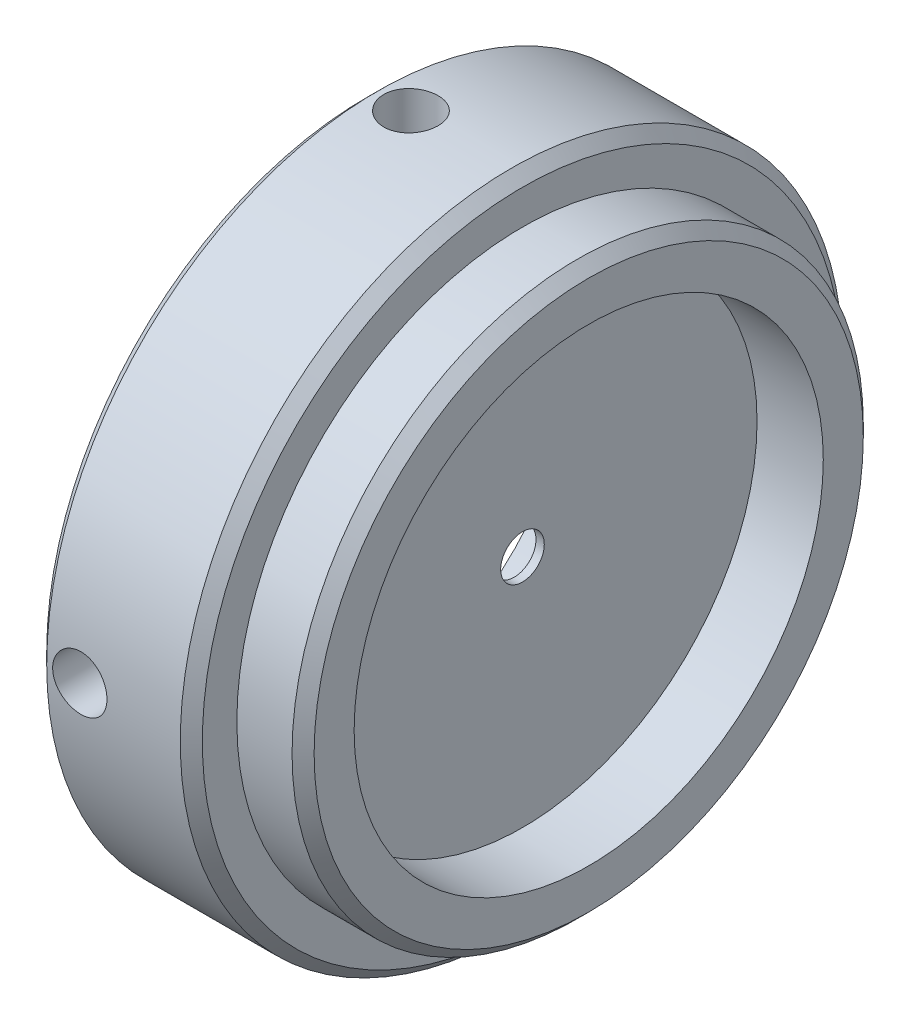
ISO-10303-21;
HEADER;
FILE_DESCRIPTION(('STEP AP214'),'2;1');
FILE_NAME('part.step','',(''),(''),'','','');
FILE_SCHEMA(('AUTOMOTIVE_DESIGN { 1 0 10303 214 1 1 1 1 }'));
ENDSEC;
DATA;
#1=APPLICATION_CONTEXT('core data for automotive mechanical design processes');
#2=APPLICATION_PROTOCOL_DEFINITION('international standard','automotive_design',2000,#1);
#3=PRODUCT_CONTEXT('',#1,'mechanical');
#4=PRODUCT('Part','Part','',(#3));
#5=PRODUCT_RELATED_PRODUCT_CATEGORY('part','',(#4));
#6=PRODUCT_DEFINITION_FORMATION('','',#4);
#7=PRODUCT_DEFINITION_CONTEXT('part definition',#1,'design');
#8=PRODUCT_DEFINITION('design','',#6,#7);
#9=PRODUCT_DEFINITION_SHAPE('','',#8);
#10=(LENGTH_UNIT() NAMED_UNIT(*) SI_UNIT(.MILLI.,.METRE.));
#11=(NAMED_UNIT(*) PLANE_ANGLE_UNIT() SI_UNIT($,.RADIAN.));
#12=(NAMED_UNIT(*) SI_UNIT($,.STERADIAN.) SOLID_ANGLE_UNIT());
#13=UNCERTAINTY_MEASURE_WITH_UNIT(LENGTH_MEASURE(1.E-05),#10,'distance_accuracy_value','');
#14=(GEOMETRIC_REPRESENTATION_CONTEXT(3) GLOBAL_UNCERTAINTY_ASSIGNED_CONTEXT((#13)) GLOBAL_UNIT_ASSIGNED_CONTEXT((#10,
#11,#12)) REPRESENTATION_CONTEXT('',''));
#15=CARTESIAN_POINT('',(0.,0.,0.));
#16=DIRECTION('',(0.,0.,1.));
#17=DIRECTION('',(1.,0.,0.));
#18=AXIS2_PLACEMENT_3D('',#15,#16,#17);
#19=CARTESIAN_POINT('',(-3.0988,5.7106676848107,0.));
#20=DIRECTION('',(-1.,0.,0.));
#21=DIRECTION('',(0.,0.,1.));
#22=AXIS2_PLACEMENT_3D('',#19,#20,#21);
#23=PLANE('',#22);
#24=CARTESIAN_POINT('',(-3.0988,0.,0.));
#25=DIRECTION('',(1.,0.,0.));
#26=DIRECTION('',(0.,0.,-1.));
#27=AXIS2_PLACEMENT_3D('',#24,#25,#26);
#28=CIRCLE('',#27,5.7106676848107);
#29=CARTESIAN_POINT('',(-3.0988,0.,-5.7106676848107));
#30=VERTEX_POINT('',#29);
#31=EDGE_CURVE('E62',#30,#30,#28,.T.);
#32=ORIENTED_EDGE('',*,*,#31,.T.);
#33=EDGE_LOOP('',(#32));
#34=FACE_BOUND('',#33,.T.);
#35=CARTESIAN_POINT('',(-3.0988,0.,0.));
#36=DIRECTION('',(1.,0.,0.));
#37=DIRECTION('',(0.,0.,-1.));
#38=AXIS2_PLACEMENT_3D('',#35,#36,#37);
#39=CIRCLE('',#38,9.525);
#40=CARTESIAN_POINT('',(-3.0988,0.,-9.525));
#41=VERTEX_POINT('',#40);
#42=EDGE_CURVE('E83',#41,#41,#39,.T.);
#43=ORIENTED_EDGE('',*,*,#42,.F.);
#44=EDGE_LOOP('',(#43));
#45=FACE_BOUND('',#44,.T.);
#46=ADVANCED_FACE('F36',(#34,#45),#23,.T.);
#47=CARTESIAN_POINT('',(-3.0988,0.,0.));
#48=DIRECTION('',(-1.,0.,0.));
#49=DIRECTION('',(0.,0.,1.));
#50=AXIS2_PLACEMENT_3D('',#47,#48,#49);
#51=CONICAL_SURFACE('',#50,5.7106676848107,1.0471975511966);
#52=CARTESIAN_POINT('',(-0.381000000000007,0.,0.));
#53=DIRECTION('',(1.,0.,0.));
#54=DIRECTION('',(0.,0.,-1.));
#55=AXIS2_PLACEMENT_3D('',#52,#53,#54);
#56=CIRCLE('',#55,1.0033);
#57=CARTESIAN_POINT('',(-0.381000000000007,0.,-1.0033));
#58=VERTEX_POINT('',#57);
#59=EDGE_CURVE('E65',#58,#58,#56,.T.);
#60=ORIENTED_EDGE('',*,*,#59,.T.);
#61=EDGE_LOOP('',(#60));
#62=FACE_BOUND('',#61,.T.);
#63=ORIENTED_EDGE('',*,*,#31,.F.);
#64=EDGE_LOOP('',(#63));
#65=FACE_BOUND('',#64,.T.);
#66=ADVANCED_FACE('F124',(#62,#65),#51,.F.);
#67=CARTESIAN_POINT('',(0.,0.,0.));
#68=DIRECTION('',(1.,0.,0.));
#69=DIRECTION('',(0.,0.,-1.));
#70=AXIS2_PLACEMENT_3D('',#67,#68,#69);
#71=CYLINDRICAL_SURFACE('',#70,1.0033);
#72=CARTESIAN_POINT('',(0.,0.,0.));
#73=DIRECTION('',(1.,0.,0.));
#74=DIRECTION('',(0.,0.,-1.));
#75=AXIS2_PLACEMENT_3D('',#72,#73,#74);
#76=CIRCLE('',#75,1.0033);
#77=CARTESIAN_POINT('',(0.,0.,-1.0033));
#78=VERTEX_POINT('',#77);
#79=EDGE_CURVE('E68',#78,#78,#76,.T.);
#80=ORIENTED_EDGE('',*,*,#79,.T.);
#81=EDGE_LOOP('',(#80));
#82=FACE_BOUND('',#81,.T.);
#83=ORIENTED_EDGE('',*,*,#59,.F.);
#84=EDGE_LOOP('',(#83));
#85=FACE_BOUND('',#84,.T.);
#86=ADVANCED_FACE('F130',(#82,#85),#71,.F.);
#87=CARTESIAN_POINT('',(0.,10.795,0.));
#88=DIRECTION('',(1.,0.,0.));
#89=DIRECTION('',(0.,0.,-1.));
#90=AXIS2_PLACEMENT_3D('',#87,#88,#89);
#91=PLANE('',#90);
#92=CARTESIAN_POINT('',(0.,0.,0.));
#93=DIRECTION('',(1.,0.,0.));
#94=DIRECTION('',(0.,0.,-1.));
#95=AXIS2_PLACEMENT_3D('',#92,#93,#94);
#96=CIRCLE('',#95,10.795);
#97=CARTESIAN_POINT('',(0.,0.,-10.795));
#98=VERTEX_POINT('',#97);
#99=EDGE_CURVE('E71',#98,#98,#96,.T.);
#100=ORIENTED_EDGE('',*,*,#99,.T.);
#101=EDGE_LOOP('',(#100));
#102=FACE_BOUND('',#101,.T.);
#103=ORIENTED_EDGE('',*,*,#79,.F.);
#104=EDGE_LOOP('',(#103));
#105=FACE_BOUND('',#104,.T.);
#106=ADVANCED_FACE('F167',(#102,#105),#91,.T.);
#107=CARTESIAN_POINT('',(0.,0.,0.));
#108=DIRECTION('',(1.,0.,0.));
#109=DIRECTION('',(0.,0.,-1.));
#110=AXIS2_PLACEMENT_3D('',#107,#108,#109);
#111=CYLINDRICAL_SURFACE('',#110,10.795);
#112=CARTESIAN_POINT('',(3.048,0.,0.));
#113=DIRECTION('',(1.,0.,0.));
#114=DIRECTION('',(0.,0.,-1.));
#115=AXIS2_PLACEMENT_3D('',#112,#113,#114);
#116=CIRCLE('',#115,10.795);
#117=CARTESIAN_POINT('',(3.048,0.,-10.795));
#118=VERTEX_POINT('',#117);
#119=EDGE_CURVE('E74',#118,#118,#116,.T.);
#120=ORIENTED_EDGE('',*,*,#119,.T.);
#121=EDGE_LOOP('',(#120));
#122=FACE_BOUND('',#121,.T.);
#123=ORIENTED_EDGE('',*,*,#99,.F.);
#124=EDGE_LOOP('',(#123));
#125=FACE_BOUND('',#124,.T.);
#126=ADVANCED_FACE('F161',(#122,#125),#111,.F.);
#127=CARTESIAN_POINT('',(3.048,13.1445,0.));
#128=DIRECTION('',(1.,0.,0.));
#129=DIRECTION('',(0.,0.,-1.));
#130=AXIS2_PLACEMENT_3D('',#127,#128,#129);
#131=PLANE('',#130);
#132=CARTESIAN_POINT('',(3.048,0.,0.));
#133=DIRECTION('',(1.,0.,0.));
#134=DIRECTION('',(0.,0.,-1.));
#135=AXIS2_PLACEMENT_3D('',#132,#133,#134);
#136=CIRCLE('',#135,12.6365);
#137=CARTESIAN_POINT('',(3.048,0.,-12.6365));
#138=VERTEX_POINT('',#137);
#139=EDGE_CURVE('E59',#138,#138,#136,.T.);
#140=ORIENTED_EDGE('',*,*,#139,.T.);
#141=EDGE_LOOP('',(#140));
#142=FACE_BOUND('',#141,.T.);
#143=ORIENTED_EDGE('',*,*,#119,.F.);
#144=EDGE_LOOP('',(#143));
#145=FACE_BOUND('',#144,.T.);
#146=ADVANCED_FACE('F155',(#142,#145),#131,.T.);
#147=CARTESIAN_POINT('',(0.,0.,0.));
#148=DIRECTION('',(1.,0.,0.));
#149=DIRECTION('',(0.,0.,-1.));
#150=AXIS2_PLACEMENT_3D('',#147,#148,#149);
#151=CYLINDRICAL_SURFACE('',#150,13.1445);
#152=CARTESIAN_POINT('',(2.54,0.,0.));
#153=DIRECTION('',(1.,0.,0.));
#154=DIRECTION('',(0.,0.,-1.));
#155=AXIS2_PLACEMENT_3D('',#152,#153,#154);
#156=CIRCLE('',#155,13.1445);
#157=CARTESIAN_POINT('',(2.54,0.,-13.1445));
#158=VERTEX_POINT('',#157);
#159=EDGE_CURVE('E56',#158,#158,#156,.F.);
#160=ORIENTED_EDGE('',*,*,#159,.T.);
#161=EDGE_LOOP('',(#160));
#162=FACE_BOUND('',#161,.T.);
#163=CARTESIAN_POINT('',(0.,0.,0.));
#164=DIRECTION('',(1.,0.,0.));
#165=DIRECTION('',(0.,0.,-1.));
#166=AXIS2_PLACEMENT_3D('',#163,#164,#165);
#167=CIRCLE('',#166,13.1445);
#168=CARTESIAN_POINT('',(0.,0.,-13.1445));
#169=VERTEX_POINT('',#168);
#170=EDGE_CURVE('E77',#169,#169,#167,.T.);
#171=ORIENTED_EDGE('',*,*,#170,.T.);
#172=EDGE_LOOP('',(#171));
#173=FACE_BOUND('',#172,.T.);
#174=ADVANCED_FACE('F151',(#162,#173),#151,.T.);
#175=CARTESIAN_POINT('',(0.,15.24,0.));
#176=DIRECTION('',(1.,0.,0.));
#177=DIRECTION('',(0.,0.,-1.));
#178=AXIS2_PLACEMENT_3D('',#175,#176,#177);
#179=PLANE('',#178);
#180=CARTESIAN_POINT('',(0.,0.,0.));
#181=DIRECTION('',(1.,0.,0.));
#182=DIRECTION('',(0.,0.,-1.));
#183=AXIS2_PLACEMENT_3D('',#180,#181,#182);
#184=CIRCLE('',#183,14.732);
#185=CARTESIAN_POINT('',(0.,0.,-14.732));
#186=VERTEX_POINT('',#185);
#187=EDGE_CURVE('E51',#186,#186,#184,.T.);
#188=ORIENTED_EDGE('',*,*,#187,.T.);
#189=EDGE_LOOP('',(#188));
#190=FACE_BOUND('',#189,.T.);
#191=ORIENTED_EDGE('',*,*,#170,.F.);
#192=EDGE_LOOP('',(#191));
#193=FACE_BOUND('',#192,.T.);
#194=ADVANCED_FACE('F121',(#190,#193),#179,.T.);
#195=CARTESIAN_POINT('',(0.,0.,0.));
#196=DIRECTION('',(1.,0.,0.));
#197=DIRECTION('',(0.,0.,-1.));
#198=AXIS2_PLACEMENT_3D('',#195,#196,#197);
#199=CYLINDRICAL_SURFACE('',#198,15.24);
#200=CARTESIAN_POINT('',(-0.508000000000004,0.,0.));
#201=DIRECTION('',(1.,0.,0.));
#202=DIRECTION('',(0.,0.,-1.));
#203=AXIS2_PLACEMENT_3D('',#200,#201,#202);
#204=CIRCLE('',#203,15.24);
#205=CARTESIAN_POINT('',(-0.508000000000004,0.,-15.24));
#206=VERTEX_POINT('',#205);
#207=EDGE_CURVE('E43',#206,#206,#204,.F.);
#208=ORIENTED_EDGE('',*,*,#207,.T.);
#209=EDGE_LOOP('',(#208));
#210=FACE_BOUND('',#209,.T.);
#211=CARTESIAN_POINT('',(-6.6548,0.,0.));
#212=DIRECTION('',(-1.,0.,0.));
#213=DIRECTION('',(0.,0.,1.));
#214=AXIS2_PLACEMENT_3D('',#211,#212,#213);
#215=CIRCLE('',#214,15.24);
#216=CARTESIAN_POINT('',(-6.6548,0.,15.24));
#217=VERTEX_POINT('',#216);
#218=EDGE_CURVE('E47',#217,#217,#215,.F.);
#219=ORIENTED_EDGE('',*,*,#218,.T.);
#220=EDGE_LOOP('',(#219));
#221=FACE_BOUND('',#220,.T.);
#222=CARTESIAN_POINT('',(-5.1308,15.1886503679557,1.25));
#223=CARTESIAN_POINT('',(-5.06071376947096,15.1886510487574,1.24999693665967));
#224=CARTESIAN_POINT('',(-4.9905797281011,15.1891406969732,1.24408567548658));
#225=CARTESIAN_POINT('',(-4.85225188020233,15.1910463824904,1.22059139305494));
#226=CARTESIAN_POINT('',(-4.78406036816819,15.1924634714853,1.20299512097024));
#227=CARTESIAN_POINT('',(-4.65164106916812,15.1960624624168,1.15664289534043));
#228=CARTESIAN_POINT('',(-4.58741106977679,15.1982439328291,1.12789323735693));
#229=CARTESIAN_POINT('',(-4.46470382552808,15.2031253491898,1.06006146540772));
#230=CARTESIAN_POINT('',(-4.40622534827616,15.2058251836993,1.02098157157719));
#231=CARTESIAN_POINT('',(-4.29652006129159,15.2114466794332,0.933493393358492));
#232=CARTESIAN_POINT('',(-4.24530955134249,15.2143688173725,0.885064698746849));
#233=CARTESIAN_POINT('',(-4.15173387804897,15.2201012980882,0.780296762023627));
#234=CARTESIAN_POINT('',(-4.1093690998852,15.2229116359922,0.723957175616873));
#235=CARTESIAN_POINT('',(-4.03463346129712,15.228108361628,0.604869786886786));
#236=CARTESIAN_POINT('',(-4.00227667241689,15.2304941504484,0.542113125326034));
#237=CARTESIAN_POINT('',(-3.94856551501322,15.2345678332319,0.412034835764901));
#238=CARTESIAN_POINT('',(-3.92721095926648,15.2362557390707,0.344713285466593));
#239=CARTESIAN_POINT('',(-3.89615727856568,15.2387401450296,0.207578213182864));
#240=CARTESIAN_POINT('',(-3.88643182344337,15.2395386585959,0.137770690609393));
#241=CARTESIAN_POINT('',(-3.87883102440433,15.2401611295789,-0.00249015693999184));
#242=CARTESIAN_POINT('',(-3.88095546630844,15.2399851046098,-0.0729434702206811));
#243=CARTESIAN_POINT('',(-3.89697260997993,15.2386799943906,-0.212317468424485));
#244=CARTESIAN_POINT('',(-3.91083699706375,15.2375532022469,-0.281241431787787));
#245=CARTESIAN_POINT('',(-3.94989645143923,15.2344759425071,-0.415780663920283));
#246=CARTESIAN_POINT('',(-3.97509162367785,15.232525467282,-0.481395902037446));
#247=CARTESIAN_POINT('',(-4.03612904334449,15.2280163393211,-0.607545264830665));
#248=CARTESIAN_POINT('',(-4.07198398244936,15.2254569623477,-0.668073221698355));
#249=CARTESIAN_POINT('',(-4.15331392937552,15.2200176799822,-0.78226253449803));
#250=CARTESIAN_POINT('',(-4.19878912613711,15.2171377682956,-0.835923755535216));
#251=CARTESIAN_POINT('',(-4.29822832150583,15.2113710942443,-0.935021883888042));
#252=CARTESIAN_POINT('',(-4.35221692179629,15.2084843366779,-0.980434108758529));
#253=CARTESIAN_POINT('',(-4.46706461721358,15.203037863758,-1.06155449480594));
#254=CARTESIAN_POINT('',(-4.52792371775046,15.2004781486621,-1.09726264834149));
#255=CARTESIAN_POINT('',(-4.65480206062534,15.1959750915957,-1.15796027056289));
#256=CARTESIAN_POINT('',(-4.72082191025799,15.1940318223023,-1.18294847551995));
#257=CARTESIAN_POINT('',(-4.85613949857541,15.1909830700441,-1.22147869108227));
#258=CARTESIAN_POINT('',(-4.92543717049907,15.1898775700237,-1.23502093470749));
#259=CARTESIAN_POINT('',(-5.06512736263481,15.1886322712494,-1.25024360196574));
#260=CARTESIAN_POINT('',(-5.13551610888563,15.1884896709407,-1.25195843772964));
#261=CARTESIAN_POINT('',(-5.27558008154828,15.1891789216219,-1.24356773705735));
#262=CARTESIAN_POINT('',(-5.34525531439856,15.190010763811,-1.23346230737726));
#263=CARTESIAN_POINT('',(-5.48181574979161,15.1925526159258,-1.20174661274641));
#264=CARTESIAN_POINT('',(-5.54870470329089,15.1942614010699,-1.18015239206539));
#265=CARTESIAN_POINT('',(-5.67791001052796,15.1983635826996,-1.12608840241363));
#266=CARTESIAN_POINT('',(-5.74022629313223,15.2007569898324,-1.0936184643014));
#267=CARTESIAN_POINT('',(-5.85867484301249,15.2059655281507,-1.01863760380737));
#268=CARTESIAN_POINT('',(-5.91479254560598,15.2087816173889,-0.976103740898647));
#269=CARTESIAN_POINT('',(-6.01910379145066,15.214514966683,-0.882235561024442));
#270=CARTESIAN_POINT('',(-6.06729720254288,15.2174322284252,-0.830901097314325));
#271=CARTESIAN_POINT('',(-6.15450920421622,15.2230475496415,-0.720740249978711));
#272=CARTESIAN_POINT('',(-6.19350544268864,15.2257450648643,-0.661896139110731));
#273=CARTESIAN_POINT('',(-6.26106280253717,15.2306091116672,-0.538474751670093));
#274=CARTESIAN_POINT('',(-6.289624025386,15.2327756484105,-0.473897530855233));
#275=CARTESIAN_POINT('',(-6.33546218372748,15.2363311167826,-0.340923275837679));
#276=CARTESIAN_POINT('',(-6.35275296449343,15.2377210021946,-0.272531040830158));
#277=CARTESIAN_POINT('',(-6.3756046719817,15.2395704331906,-0.133802274194766));
#278=CARTESIAN_POINT('',(-6.38116581310292,15.2400299957794,-0.0634657781286585));
#279=CARTESIAN_POINT('',(-6.38039791356778,15.2399670290435,0.0769345243982014));
#280=CARTESIAN_POINT('',(-6.37410371781067,15.2394473777968,0.146998525366217));
#281=CARTESIAN_POINT('',(-6.34987644755059,15.2374900680651,0.285070822349682));
#282=CARTESIAN_POINT('',(-6.33194335684046,15.2360524083019,0.353079115502424));
#283=CARTESIAN_POINT('',(-6.28495614469714,15.2324204077344,0.485111947474416));
#284=CARTESIAN_POINT('',(-6.25590261905166,15.2302261074686,0.549136699502014));
#285=CARTESIAN_POINT('',(-6.18750329303653,15.2253263754577,0.671405377599671));
#286=CARTESIAN_POINT('',(-6.14815766279731,15.2226209521618,0.729649399204351));
#287=CARTESIAN_POINT('',(-6.06016026868922,15.2169932162182,0.838881548781791));
#288=CARTESIAN_POINT('',(-6.01148274335006,15.2140703172074,0.889848892966019));
#289=CARTESIAN_POINT('',(-5.90624936996131,15.2083420391511,0.982910147379538));
#290=CARTESIAN_POINT('',(-5.84969161542808,15.2055366887587,1.02500190410334));
#291=CARTESIAN_POINT('',(-5.73019674905055,15.2003555726044,1.09917224408041));
#292=CARTESIAN_POINT('',(-5.66724816796558,15.1979806012672,1.13123238792295));
#293=CARTESIAN_POINT('',(-5.53688507229848,15.1939388661739,1.18428723191015));
#294=CARTESIAN_POINT('',(-5.46947580031743,15.1922712875341,1.20529467100044));
#295=CARTESIAN_POINT('',(-5.35652313182699,15.1902626019648,1.23028958299843));
#296=CARTESIAN_POINT('',(-5.31170646739039,15.1896607879226,1.23767118313616));
#297=CARTESIAN_POINT('',(-5.22153321479678,15.188854451043,1.24752737695141));
#298=CARTESIAN_POINT('',(-5.17617662803748,15.1886499271774,1.25000198332901));
#299=CARTESIAN_POINT('',(-5.1308,15.1886503679557,1.25));
#300=B_SPLINE_CURVE_WITH_KNOTS('',3,(#222,#223,#224,#225,#226,#227,#228,#229,#230,#231,#232,
#233,#234,#235,#236,#237,#238,#239,#240,#241,#242,#243,#244,#245,#246,#247,#248,#249,#250,#251,
#252,#253,#254,#255,#256,#257,#258,#259,#260,#261,#262,#263,#264,#265,#266,#267,#268,#269,#270,
#271,#272,#273,#274,#275,#276,#277,#278,#279,#280,#281,#282,#283,#284,#285,#286,#287,#288,#289,
#290,#291,#292,#293,#294,#295,#296,#297,#298,#299),.UNSPECIFIED.,.T.,.F.,(4,2,2,2,2,2,2,2,2,2,2,
2,2,2,2,2,2,2,2,2,2,2,2,2,2,2,2,2,2,2,2,2,2,2,2,2,2,2,4),(0.,0.210093014811108,0.42042468330576,
0.630637801802253,0.840805778771281,1.05143789069166,1.26207917251502,1.47301529014935,
1.68394781819759,1.89440185098846,2.10485207997246,2.31479618096626,2.5247422265251,
2.73493924489037,2.94514039187428,3.15596049351967,3.36678076117285,3.57762587469913,
3.78846669568032,3.99869381040831,4.20891902646037,4.41885142749332,4.62878709359161,
4.83920599436575,5.04962840408763,5.26055705672531,5.47148365818499,5.68215065421329,
5.89281379955542,6.10285873525329,6.31290396343906,6.52293793982973,6.7329684445383,
6.9435873297619,7.15425725930736,7.36531218317591,7.57612331696313,7.71214628735576,
7.84816890569883),.UNSPECIFIED.);
#301=CARTESIAN_POINT('',(-5.1308,15.1886503679557,1.25));
#302=VERTEX_POINT('',#301);
#303=EDGE_CURVE('E263',#302,#302,#300,.T.);
#304=ORIENTED_EDGE('',*,*,#303,.F.);
#305=EDGE_LOOP('',(#304));
#306=FACE_BOUND('',#305,.T.);
#307=CARTESIAN_POINT('',(-5.1308,-1.25,15.1886503679557));
#308=CARTESIAN_POINT('',(-5.06071376947096,-1.24999693665967,15.1886510487574));
#309=CARTESIAN_POINT('',(-4.99057972810109,-1.24408567548658,15.1891406969732));
#310=CARTESIAN_POINT('',(-4.85225188020233,-1.22059139305494,15.1910463824904));
#311=CARTESIAN_POINT('',(-4.78406036816819,-1.20299512097024,15.1924634714853));
#312=CARTESIAN_POINT('',(-4.65164106916812,-1.15664289534043,15.1960624624168));
#313=CARTESIAN_POINT('',(-4.58741106977679,-1.12789323735693,15.1982439328291));
#314=CARTESIAN_POINT('',(-4.46470382552807,-1.06006146540772,15.2031253491898));
#315=CARTESIAN_POINT('',(-4.40622534827616,-1.02098157157719,15.2058251836993));
#316=CARTESIAN_POINT('',(-4.29652006129159,-0.933493393358492,15.2114466794332));
#317=CARTESIAN_POINT('',(-4.24530955134249,-0.885064698746849,15.2143688173725));
#318=CARTESIAN_POINT('',(-4.15173387804897,-0.780296762023627,15.2201012980882));
#319=CARTESIAN_POINT('',(-4.1093690998852,-0.723957175616872,15.2229116359922));
#320=CARTESIAN_POINT('',(-4.03463346129712,-0.604869786886785,15.228108361628));
#321=CARTESIAN_POINT('',(-4.00227667241689,-0.542113125326033,15.2304941504484));
#322=CARTESIAN_POINT('',(-3.94856551501322,-0.4120348357649,15.2345678332319));
#323=CARTESIAN_POINT('',(-3.92721095926648,-0.344713285466592,15.2362557390707));
#324=CARTESIAN_POINT('',(-3.89615727856568,-0.207578213182863,15.2387401450296));
#325=CARTESIAN_POINT('',(-3.88643182344337,-0.137770690609392,15.2395386585959));
#326=CARTESIAN_POINT('',(-3.87883102440433,0.00249015693999267,15.2401611295789));
#327=CARTESIAN_POINT('',(-3.88095546630844,0.0729434702206819,15.2399851046098));
#328=CARTESIAN_POINT('',(-3.89697260997993,0.212317468424486,15.2386799943906));
#329=CARTESIAN_POINT('',(-3.91083699706375,0.281241431787788,15.2375532022469));
#330=CARTESIAN_POINT('',(-3.94989645143923,0.415780663920284,15.2344759425071));
#331=CARTESIAN_POINT('',(-3.97509162367785,0.481395902037446,15.232525467282));
#332=CARTESIAN_POINT('',(-4.03612904334449,0.607545264830666,15.2280163393211));
#333=CARTESIAN_POINT('',(-4.07198398244936,0.668073221698355,15.2254569623477));
#334=CARTESIAN_POINT('',(-4.15331392937552,0.782262534498031,15.2200176799822));
#335=CARTESIAN_POINT('',(-4.1987891261371,0.835923755535216,15.2171377682956));
#336=CARTESIAN_POINT('',(-4.29822832150583,0.935021883888043,15.2113710942443));
#337=CARTESIAN_POINT('',(-4.35221692179629,0.98043410875853,15.2084843366779));
#338=CARTESIAN_POINT('',(-4.46706461721358,1.06155449480594,15.203037863758));
#339=CARTESIAN_POINT('',(-4.52792371775046,1.09726264834149,15.2004781486621));
#340=CARTESIAN_POINT('',(-4.65480206062534,1.15796027056289,15.1959750915957));
#341=CARTESIAN_POINT('',(-4.72082191025799,1.18294847551995,15.1940318223023));
#342=CARTESIAN_POINT('',(-4.85613949857542,1.22147869108227,15.1909830700441));
#343=CARTESIAN_POINT('',(-4.92543717049907,1.23502093470749,15.1898775700237));
#344=CARTESIAN_POINT('',(-5.06512736263481,1.25024360196574,15.1886322712494));
#345=CARTESIAN_POINT('',(-5.13551610888563,1.25195843772964,15.1884896709407));
#346=CARTESIAN_POINT('',(-5.27558008154828,1.24356773705735,15.1891789216219));
#347=CARTESIAN_POINT('',(-5.34525531439856,1.23346230737726,15.190010763811));
#348=CARTESIAN_POINT('',(-5.48181574979161,1.20174661274641,15.1925526159258));
#349=CARTESIAN_POINT('',(-5.54870470329088,1.18015239206539,15.1942614010699));
#350=CARTESIAN_POINT('',(-5.67791001052796,1.12608840241363,15.1983635826996));
#351=CARTESIAN_POINT('',(-5.74022629313223,1.0936184643014,15.2007569898324));
#352=CARTESIAN_POINT('',(-5.8586748430125,1.01863760380737,15.2059655281507));
#353=CARTESIAN_POINT('',(-5.91479254560598,0.976103740898646,15.2087816173889));
#354=CARTESIAN_POINT('',(-6.01910379145066,0.88223556102444,15.214514966683));
#355=CARTESIAN_POINT('',(-6.06729720254288,0.830901097314324,15.2174322284252));
#356=CARTESIAN_POINT('',(-6.15450920421622,0.720740249978711,15.2230475496415));
#357=CARTESIAN_POINT('',(-6.19350544268864,0.66189613911073,15.2257450648643));
#358=CARTESIAN_POINT('',(-6.26106280253717,0.538474751670092,15.2306091116672));
#359=CARTESIAN_POINT('',(-6.289624025386,0.473897530855233,15.2327756484105));
#360=CARTESIAN_POINT('',(-6.33546218372748,0.340923275837678,15.2363311167826));
#361=CARTESIAN_POINT('',(-6.35275296449343,0.272531040830157,15.2377210021946));
#362=CARTESIAN_POINT('',(-6.3756046719817,0.133802274194765,15.2395704331906));
#363=CARTESIAN_POINT('',(-6.38116581310292,0.0634657781286575,15.2400299957794));
#364=CARTESIAN_POINT('',(-6.38039791356778,-0.0769345243982023,15.2399670290435));
#365=CARTESIAN_POINT('',(-6.37410371781067,-0.146998525366217,15.2394473777968));
#366=CARTESIAN_POINT('',(-6.34987644755059,-0.285070822349683,15.2374900680651));
#367=CARTESIAN_POINT('',(-6.33194335684046,-0.353079115502425,15.2360524083019));
#368=CARTESIAN_POINT('',(-6.28495614469714,-0.485111947474417,15.2324204077344));
#369=CARTESIAN_POINT('',(-6.25590261905166,-0.549136699502014,15.2302261074686));
#370=CARTESIAN_POINT('',(-6.18750329303653,-0.671405377599671,15.2253263754577));
#371=CARTESIAN_POINT('',(-6.14815766279731,-0.729649399204351,15.2226209521618));
#372=CARTESIAN_POINT('',(-6.06016026868922,-0.838881548781792,15.2169932162182));
#373=CARTESIAN_POINT('',(-6.01148274335005,-0.88984889296602,15.2140703172074));
#374=CARTESIAN_POINT('',(-5.90624936996131,-0.982910147379539,15.2083420391511));
#375=CARTESIAN_POINT('',(-5.84969161542808,-1.02500190410334,15.2055366887587));
#376=CARTESIAN_POINT('',(-5.73019674905054,-1.09917224408041,15.2003555726044));
#377=CARTESIAN_POINT('',(-5.66724816796558,-1.13123238792295,15.1979806012672));
#378=CARTESIAN_POINT('',(-5.53688507229848,-1.18428723191015,15.1939388661739));
#379=CARTESIAN_POINT('',(-5.46947580031743,-1.20529467100044,15.1922712875341));
#380=CARTESIAN_POINT('',(-5.35652313182699,-1.23028958299843,15.1902626019648));
#381=CARTESIAN_POINT('',(-5.31170646739039,-1.23767118313616,15.1896607879226));
#382=CARTESIAN_POINT('',(-5.22153321479678,-1.24752737695141,15.188854451043));
#383=CARTESIAN_POINT('',(-5.17617662803747,-1.25000198332901,15.1886499271774));
#384=CARTESIAN_POINT('',(-5.1308,-1.25,15.1886503679557));
#385=B_SPLINE_CURVE_WITH_KNOTS('',3,(#307,#308,#309,#310,#311,#312,#313,#314,#315,#316,#317,
#318,#319,#320,#321,#322,#323,#324,#325,#326,#327,#328,#329,#330,#331,#332,#333,#334,#335,#336,
#337,#338,#339,#340,#341,#342,#343,#344,#345,#346,#347,#348,#349,#350,#351,#352,#353,#354,#355,
#356,#357,#358,#359,#360,#361,#362,#363,#364,#365,#366,#367,#368,#369,#370,#371,#372,#373,#374,
#375,#376,#377,#378,#379,#380,#381,#382,#383,#384),.UNSPECIFIED.,.T.,.F.,(4,2,2,2,2,2,2,2,2,2,2,
2,2,2,2,2,2,2,2,2,2,2,2,2,2,2,2,2,2,2,2,2,2,2,2,2,2,2,4),(0.,0.210093014811109,
0.420424683305761,0.630637801802253,0.840805778771282,1.05143789069166,1.26207917251502,
1.47301529014935,1.68394781819759,1.89440185098846,2.10485207997246,2.31479618096626,
2.5247422265251,2.73493924489037,2.94514039187427,3.15596049351967,3.36678076117285,
3.57762587469913,3.78846669568032,3.99869381040831,4.20891902646037,4.41885142749332,
4.62878709359161,4.83920599436576,5.04962840408763,5.26055705672531,5.47148365818499,
5.68215065421329,5.89281379955542,6.10285873525329,6.31290396343906,6.52293793982974,
6.7329684445383,6.9435873297619,7.15425725930736,7.36531218317591,7.57612331696313,
7.71214628735576,7.84816890569883),.UNSPECIFIED.);
#386=CARTESIAN_POINT('',(-5.1308,-1.25,15.1886503679557));
#387=VERTEX_POINT('',#386);
#388=EDGE_CURVE('E86',#387,#387,#385,.T.);
#389=ORIENTED_EDGE('',*,*,#388,.F.);
#390=EDGE_LOOP('',(#389));
#391=FACE_BOUND('',#390,.T.);
#392=ADVANCED_FACE('F98',(#210,#221,#306,#391),#199,.T.);
#393=CARTESIAN_POINT('',(-7.1628,9.525,0.));
#394=DIRECTION('',(-1.,0.,0.));
#395=DIRECTION('',(0.,0.,1.));
#396=AXIS2_PLACEMENT_3D('',#393,#394,#395);
#397=PLANE('',#396);
#398=CARTESIAN_POINT('',(-7.1628,0.,0.));
#399=DIRECTION('',(-1.,0.,0.));
#400=DIRECTION('',(0.,0.,1.));
#401=AXIS2_PLACEMENT_3D('',#398,#399,#400);
#402=CIRCLE('',#401,14.732);
#403=CARTESIAN_POINT('',(-7.1628,0.,14.732));
#404=VERTEX_POINT('',#403);
#405=EDGE_CURVE('E11',#404,#404,#402,.T.);
#406=ORIENTED_EDGE('',*,*,#405,.T.);
#407=EDGE_LOOP('',(#406));
#408=FACE_BOUND('',#407,.T.);
#409=CARTESIAN_POINT('',(-7.1628,0.,0.));
#410=DIRECTION('',(1.,0.,0.));
#411=DIRECTION('',(0.,0.,-1.));
#412=AXIS2_PLACEMENT_3D('',#409,#410,#411);
#413=CIRCLE('',#412,9.525);
#414=CARTESIAN_POINT('',(-7.1628,0.,-9.525));
#415=VERTEX_POINT('',#414);
#416=EDGE_CURVE('E80',#415,#415,#413,.T.);
#417=ORIENTED_EDGE('',*,*,#416,.T.);
#418=EDGE_LOOP('',(#417));
#419=FACE_BOUND('',#418,.T.);
#420=ADVANCED_FACE('F115',(#408,#419),#397,.T.);
#421=CARTESIAN_POINT('',(0.,0.,0.));
#422=DIRECTION('',(1.,0.,0.));
#423=DIRECTION('',(0.,0.,-1.));
#424=AXIS2_PLACEMENT_3D('',#421,#422,#423);
#425=CYLINDRICAL_SURFACE('',#424,9.525);
#426=CARTESIAN_POINT('',(-5.1308,9.44262278183345,1.25));
#427=CARTESIAN_POINT('',(-5.2006879229246,9.44262382899172,1.24999704676488));
#428=CARTESIAN_POINT('',(-5.27061880465405,9.44340705893182,1.24411902617593));
#429=CARTESIAN_POINT('',(-5.4085322909658,9.44645395007768,1.22076456089956));
#430=CARTESIAN_POINT('',(-5.47651281607261,9.44871913427919,1.20327618404352));
#431=CARTESIAN_POINT('',(-5.60850897921906,9.45446904795241,1.15722726897542));
#432=CARTESIAN_POINT('',(-5.6725273537037,9.45795292442258,1.12867447359996));
#433=CARTESIAN_POINT('',(-5.79485278030748,9.46574665399519,1.06132421776895));
#434=CARTESIAN_POINT('',(-5.85316076220867,9.47005637229276,1.02252842892083));
#435=CARTESIAN_POINT('',(-5.96278043716011,9.47904588657803,0.93553785691893));
#436=CARTESIAN_POINT('',(-6.01405188743378,9.48372758759749,0.887292553607438));
#437=CARTESIAN_POINT('',(-6.1077952041892,9.49291645830577,0.782881317023071));
#438=CARTESIAN_POINT('',(-6.15026662248839,9.49742361909582,0.72671498057944));
#439=CARTESIAN_POINT('',(-6.22534968163261,9.50577518738359,0.607801834071406));
#440=CARTESIAN_POINT('',(-6.25792473780297,9.50961711368777,0.54503173495142));
#441=CARTESIAN_POINT('',(-6.31205595806615,9.51618435270104,0.414852926339323));
#442=CARTESIAN_POINT('',(-6.33361257120711,9.51890971091411,0.347444406009539));
#443=CARTESIAN_POINT('',(-6.3649743034012,9.5229233165299,0.210314626710601));
#444=CARTESIAN_POINT('',(-6.37484646591767,9.52421975983082,0.14060894438534));
#445=CARTESIAN_POINT('',(-6.38276693248468,9.5252574740753,0.000519064991666576));
#446=CARTESIAN_POINT('',(-6.38081574647823,9.52499881209081,-0.0698651026828344));
#447=CARTESIAN_POINT('',(-6.36519844076329,9.522962071708,-0.208857568076388));
#448=CARTESIAN_POINT('',(-6.3516044299363,9.5211933459786,-0.277474124378674));
#449=CARTESIAN_POINT('',(-6.31320018829105,9.51634568714643,-0.411443550633421));
#450=CARTESIAN_POINT('',(-6.28838972603448,9.5132667270086,-0.47679635321125));
#451=CARTESIAN_POINT('',(-6.22818084661467,9.50612843426833,-0.602605221657064));
#452=CARTESIAN_POINT('',(-6.19275142214563,9.50206623739833,-0.663046279109247));
#453=CARTESIAN_POINT('',(-6.11233290361214,9.49341554622401,-0.777152252495042));
#454=CARTESIAN_POINT('',(-6.06734332653444,9.48882702533332,-0.830816825837851));
#455=CARTESIAN_POINT('',(-5.96867821718398,9.4795959920313,-0.930270468158063));
#456=CARTESIAN_POINT('',(-5.91493981302686,9.4749533332703,-0.975997172682923));
#457=CARTESIAN_POINT('',(-5.80051790819222,9.46617129748114,-1.0577918346755));
#458=CARTESIAN_POINT('',(-5.73983438153453,9.46203192233578,-1.09385975601016));
#459=CARTESIAN_POINT('',(-5.61318705716308,9.45472521944366,-1.15531770342405));
#460=CARTESIAN_POINT('',(-5.54722064630606,9.45155837654466,-1.18070240580299));
#461=CARTESIAN_POINT('',(-5.41191045344004,9.44656453668813,-1.22001631261277));
#462=CARTESIAN_POINT('',(-5.34256685168478,9.44473746830505,-1.23394612772706));
#463=CARTESIAN_POINT('',(-5.20302243074468,9.44264322961335,-1.24987157074794));
#464=CARTESIAN_POINT('',(-5.13283181078519,9.44236456850673,-1.25195511305414));
#465=CARTESIAN_POINT('',(-4.99310249312112,9.44336827911228,-1.2443611367252));
#466=CARTESIAN_POINT('',(-4.92356378010021,9.44465061405629,-1.23468389510695));
#467=CARTESIAN_POINT('',(-4.78737774829936,9.44862132897221,-1.20391720244721));
#468=CARTESIAN_POINT('',(-4.72072058049374,9.45130442768757,-1.18287060665206));
#469=CARTESIAN_POINT('',(-4.59188109981989,9.45777005565516,-1.13000686292333));
#470=CARTESIAN_POINT('',(-4.52969895940182,9.46155262724852,-1.09818930018774));
#471=CARTESIAN_POINT('',(-4.41117775229129,9.4698184225945,-1.02447180307885));
#472=CARTESIAN_POINT('',(-4.35487471611468,9.47430558777399,-0.982514388970716));
#473=CARTESIAN_POINT('',(-4.25007822461124,9.48346272712817,-0.889789144389302));
#474=CARTESIAN_POINT('',(-4.20158510497959,9.48813270915019,-0.839020935394659));
#475=CARTESIAN_POINT('',(-4.11347455413268,9.49716473794462,-0.729730444172923));
#476=CARTESIAN_POINT('',(-4.0739150076873,9.50152465770153,-0.671161293848668));
#477=CARTESIAN_POINT('',(-4.00519571832511,9.50941323165278,-0.548158421789692));
#478=CARTESIAN_POINT('',(-3.97603574767195,9.5129419040497,-0.48372482851697));
#479=CARTESIAN_POINT('',(-3.92903822469673,9.51876098704451,-0.351011731873955));
#480=CARTESIAN_POINT('',(-3.91116764140335,9.52105500709757,-0.282744090564347));
#481=CARTESIAN_POINT('',(-3.88714883835324,9.52416133983854,-0.144145003875589));
#482=CARTESIAN_POINT('',(-3.88100003315121,9.52497372652666,-0.0738136617463328));
#483=CARTESIAN_POINT('',(-3.88061104708694,9.52502481920796,0.0663520766063234));
#484=CARTESIAN_POINT('',(-3.88628177407832,9.52427529840777,0.136186237953925));
#485=CARTESIAN_POINT('',(-3.90918165948917,9.52131026792484,0.273899650251574));
#486=CARTESIAN_POINT('',(-3.92641080390574,9.51909476001814,0.341778903569867));
#487=CARTESIAN_POINT('',(-3.97190960341142,9.51344554415828,0.47364096826865));
#488=CARTESIAN_POINT('',(-4.00017454076453,9.51001235681322,0.537625431156462));
#489=CARTESIAN_POINT('',(-4.06693333013582,9.50230722042008,0.659957257151115));
#490=CARTESIAN_POINT('',(-4.10542735378837,9.49803525729844,0.718304525648768));
#491=CARTESIAN_POINT('',(-4.19187960558707,9.48909056856514,0.82816018580445));
#492=CARTESIAN_POINT('',(-4.23990403271,9.48441517693336,0.879616267804765));
#493=CARTESIAN_POINT('',(-4.3439156037957,9.47521158498814,0.973773343657425));
#494=CARTESIAN_POINT('',(-4.39990462597681,9.47068341970408,1.01647226657228));
#495=CARTESIAN_POINT('',(-4.51853142689413,9.46226641258738,1.09206056783225));
#496=CARTESIAN_POINT('',(-4.58119648777145,9.45838037364774,1.12490742465831));
#497=CARTESIAN_POINT('',(-4.7111706549008,9.45172042830387,1.17956381303178));
#498=CARTESIAN_POINT('',(-4.77847467460556,9.44894532581744,1.20138522172666));
#499=CARTESIAN_POINT('',(-4.89356405250219,9.44548775371231,1.22820973038791));
#500=CARTESIAN_POINT('',(-4.94062669784209,9.44441881894445,1.23636915921843));
#501=CARTESIAN_POINT('',(-5.03538622383355,9.44298597859396,1.24726527859545));
#502=CARTESIAN_POINT('',(-5.08308309895889,9.44262206687232,1.25000201636022));
#503=CARTESIAN_POINT('',(-5.1308,9.44262278183345,1.25));
#504=B_SPLINE_CURVE_WITH_KNOTS('',3,(#426,#427,#428,#429,#430,#431,#432,#433,#434,#435,#436,
#437,#438,#439,#440,#441,#442,#443,#444,#445,#446,#447,#448,#449,#450,#451,#452,#453,#454,#455,
#456,#457,#458,#459,#460,#461,#462,#463,#464,#465,#466,#467,#468,#469,#470,#471,#472,#473,#474,
#475,#476,#477,#478,#479,#480,#481,#482,#483,#484,#485,#486,#487,#488,#489,#490,#491,#492,#493,
#494,#495,#496,#497,#498,#499,#500,#501,#502,#503),.UNSPECIFIED.,.T.,.F.,(4,2,2,2,2,2,2,2,2,2,2,
2,2,2,2,2,2,2,2,2,2,2,2,2,2,2,2,2,2,2,2,2,2,2,2,2,2,2,4),(0.,0.209489430422768,
0.419194490815409,0.62875306467769,0.838277460701332,1.04895422366042,1.25964171367799,
1.47109884823849,1.68254736433968,1.89277664925557,2.1029968670116,2.31192444101697,
2.52085632619464,2.73040433536345,2.93996293416877,3.1510999695445,3.36223779476307,
3.57348071071903,3.78471236415311,3.99437434336301,4.20403138423037,4.41290361001029,
4.62178388060885,4.83187721207305,5.04197957161134,5.25340653365123,5.46482886544808,
5.67562970833096,5.88642002246999,6.09562720910752,6.3048341422933,6.51395173850638,
6.72307284373632,6.93370084693649,7.14437860322797,7.35595297648352,7.5672989430111,
7.7103318597958,7.85336353111082),.UNSPECIFIED.);
#505=CARTESIAN_POINT('',(-5.1308,9.44262278183345,1.25));
#506=VERTEX_POINT('',#505);
#507=EDGE_CURVE('E260',#506,#506,#504,.T.);
#508=ORIENTED_EDGE('',*,*,#507,.F.);
#509=EDGE_LOOP('',(#508));
#510=FACE_BOUND('',#509,.T.);
#511=CARTESIAN_POINT('',(-5.1308,-1.25,9.44262278183345));
#512=CARTESIAN_POINT('',(-5.2006879229246,-1.24999704676489,9.44262382899172));
#513=CARTESIAN_POINT('',(-5.27061880465405,-1.24411902617593,9.44340705893182));
#514=CARTESIAN_POINT('',(-5.4085322909658,-1.22076456089956,9.44645395007768));
#515=CARTESIAN_POINT('',(-5.47651281607261,-1.20327618404352,9.44871913427919));
#516=CARTESIAN_POINT('',(-5.60850897921905,-1.15722726897542,9.45446904795241));
#517=CARTESIAN_POINT('',(-5.6725273537037,-1.12867447359996,9.45795292442258));
#518=CARTESIAN_POINT('',(-5.79485278030748,-1.06132421776895,9.46574665399519));
#519=CARTESIAN_POINT('',(-5.85316076220866,-1.02252842892083,9.47005637229276));
#520=CARTESIAN_POINT('',(-5.96278043716011,-0.93553785691893,9.47904588657803));
#521=CARTESIAN_POINT('',(-6.01405188743378,-0.887292553607439,9.48372758759749));
#522=CARTESIAN_POINT('',(-6.1077952041892,-0.782881317023071,9.49291645830576));
#523=CARTESIAN_POINT('',(-6.15026662248839,-0.72671498057944,9.49742361909581));
#524=CARTESIAN_POINT('',(-6.22534968163261,-0.607801834071406,9.50577518738359));
#525=CARTESIAN_POINT('',(-6.25792473780297,-0.54503173495142,9.50961711368777));
#526=CARTESIAN_POINT('',(-6.31205595806615,-0.414852926339323,9.51618435270104));
#527=CARTESIAN_POINT('',(-6.33361257120711,-0.347444406009539,9.51890971091411));
#528=CARTESIAN_POINT('',(-6.3649743034012,-0.2103146267106,9.5229233165299));
#529=CARTESIAN_POINT('',(-6.37484646591767,-0.14060894438534,9.52421975983082));
#530=CARTESIAN_POINT('',(-6.38276693248468,-0.000519064991666332,9.5252574740753));
#531=CARTESIAN_POINT('',(-6.38081574647823,0.0698651026828347,9.52499881209081));
#532=CARTESIAN_POINT('',(-6.36519844076329,0.208857568076388,9.522962071708));
#533=CARTESIAN_POINT('',(-6.35160442993629,0.277474124378674,9.5211933459786));
#534=CARTESIAN_POINT('',(-6.31320018829105,0.411443550633421,9.51634568714643));
#535=CARTESIAN_POINT('',(-6.28838972603448,0.476796353211251,9.51326672700859));
#536=CARTESIAN_POINT('',(-6.22818084661467,0.602605221657064,9.50612843426833));
#537=CARTESIAN_POINT('',(-6.19275142214563,0.663046279109247,9.50206623739833));
#538=CARTESIAN_POINT('',(-6.11233290361214,0.777152252495043,9.49341554622401));
#539=CARTESIAN_POINT('',(-6.06734332653444,0.830816825837852,9.48882702533332));
#540=CARTESIAN_POINT('',(-5.96867821718397,0.930270468158064,9.4795959920313));
#541=CARTESIAN_POINT('',(-5.91493981302686,0.975997172682923,9.4749533332703));
#542=CARTESIAN_POINT('',(-5.80051790819222,1.0577918346755,9.46617129748114));
#543=CARTESIAN_POINT('',(-5.73983438153453,1.09385975601016,9.46203192233578));
#544=CARTESIAN_POINT('',(-5.61318705716308,1.15531770342405,9.45472521944366));
#545=CARTESIAN_POINT('',(-5.54722064630606,1.18070240580299,9.45155837654466));
#546=CARTESIAN_POINT('',(-5.41191045344003,1.22001631261277,9.44656453668813));
#547=CARTESIAN_POINT('',(-5.34256685168478,1.23394612772706,9.44473746830505));
#548=CARTESIAN_POINT('',(-5.20302243074467,1.24987157074794,9.44264322961335));
#549=CARTESIAN_POINT('',(-5.13283181078519,1.25195511305413,9.44236456850673));
#550=CARTESIAN_POINT('',(-4.99310249312112,1.2443611367252,9.44336827911228));
#551=CARTESIAN_POINT('',(-4.92356378010021,1.23468389510695,9.44465061405629));
#552=CARTESIAN_POINT('',(-4.78737774829936,1.20391720244721,9.44862132897221));
#553=CARTESIAN_POINT('',(-4.72072058049374,1.18287060665206,9.45130442768757));
#554=CARTESIAN_POINT('',(-4.59188109981989,1.13000686292333,9.45777005565516));
#555=CARTESIAN_POINT('',(-4.52969895940182,1.09818930018774,9.46155262724852));
#556=CARTESIAN_POINT('',(-4.41117775229129,1.02447180307885,9.4698184225945));
#557=CARTESIAN_POINT('',(-4.35487471611468,0.982514388970715,9.47430558777399));
#558=CARTESIAN_POINT('',(-4.25007822461124,0.889789144389301,9.48346272712817));
#559=CARTESIAN_POINT('',(-4.20158510497959,0.839020935394659,9.48813270915019));
#560=CARTESIAN_POINT('',(-4.11347455413268,0.729730444172923,9.49716473794462));
#561=CARTESIAN_POINT('',(-4.0739150076873,0.671161293848667,9.50152465770153));
#562=CARTESIAN_POINT('',(-4.00519571832511,0.548158421789691,9.50941323165278));
#563=CARTESIAN_POINT('',(-3.97603574767195,0.483724828516968,9.5129419040497));
#564=CARTESIAN_POINT('',(-3.92903822469673,0.351011731873954,9.51876098704451));
#565=CARTESIAN_POINT('',(-3.91116764140335,0.282744090564346,9.52105500709757));
#566=CARTESIAN_POINT('',(-3.88714883835324,0.144145003875588,9.52416133983854));
#567=CARTESIAN_POINT('',(-3.88100003315121,0.0738136617463316,9.52497372652666));
#568=CARTESIAN_POINT('',(-3.88061104708694,-0.0663520766063248,9.52502481920796));
#569=CARTESIAN_POINT('',(-3.88628177407832,-0.136186237953927,9.52427529840777));
#570=CARTESIAN_POINT('',(-3.90918165948916,-0.273899650251576,9.52131026792484));
#571=CARTESIAN_POINT('',(-3.92641080390573,-0.341778903569869,9.51909476001814));
#572=CARTESIAN_POINT('',(-3.97190960341142,-0.473640968268651,9.51344554415828));
#573=CARTESIAN_POINT('',(-4.00017454076453,-0.537625431156463,9.51001235681322));
#574=CARTESIAN_POINT('',(-4.06693333013582,-0.659957257151116,9.50230722042008));
#575=CARTESIAN_POINT('',(-4.10542735378837,-0.718304525648769,9.49803525729844));
#576=CARTESIAN_POINT('',(-4.19187960558707,-0.828160185804451,9.48909056856514));
#577=CARTESIAN_POINT('',(-4.23990403271,-0.879616267804766,9.48441517693336));
#578=CARTESIAN_POINT('',(-4.3439156037957,-0.973773343657425,9.47521158498814));
#579=CARTESIAN_POINT('',(-4.3999046259768,-1.01647226657228,9.47068341970408));
#580=CARTESIAN_POINT('',(-4.51853142689412,-1.09206056783225,9.46226641258738));
#581=CARTESIAN_POINT('',(-4.58119648777145,-1.12490742465832,9.45838037364774));
#582=CARTESIAN_POINT('',(-4.7111706549008,-1.17956381303178,9.45172042830387));
#583=CARTESIAN_POINT('',(-4.77847467460556,-1.20138522172666,9.44894532581744));
#584=CARTESIAN_POINT('',(-4.89356405250219,-1.22820973038791,9.44548775371231));
#585=CARTESIAN_POINT('',(-4.94062669784209,-1.23636915921843,9.44441881894445));
#586=CARTESIAN_POINT('',(-5.03538622383355,-1.24726527859545,9.44298597859396));
#587=CARTESIAN_POINT('',(-5.08308309895889,-1.25000201636022,9.44262206687232));
#588=CARTESIAN_POINT('',(-5.1308,-1.25,9.44262278183345));
#589=B_SPLINE_CURVE_WITH_KNOTS('',3,(#511,#512,#513,#514,#515,#516,#517,#518,#519,#520,#521,
#522,#523,#524,#525,#526,#527,#528,#529,#530,#531,#532,#533,#534,#535,#536,#537,#538,#539,#540,
#541,#542,#543,#544,#545,#546,#547,#548,#549,#550,#551,#552,#553,#554,#555,#556,#557,#558,#559,
#560,#561,#562,#563,#564,#565,#566,#567,#568,#569,#570,#571,#572,#573,#574,#575,#576,#577,#578,
#579,#580,#581,#582,#583,#584,#585,#586,#587,#588),.UNSPECIFIED.,.T.,.F.,(4,2,2,2,2,2,2,2,2,2,2,
2,2,2,2,2,2,2,2,2,2,2,2,2,2,2,2,2,2,2,2,2,2,2,2,2,2,2,4),(0.,0.209489430422768,
0.419194490815409,0.628753064677689,0.838277460701332,1.04895422366042,1.25964171367799,
1.47109884823849,1.68254736433968,1.89277664925557,2.1029968670116,2.31192444101697,
2.52085632619464,2.73040433536345,2.93996293416877,3.1510999695445,3.36223779476307,
3.57348071071904,3.78471236415311,3.99437434336301,4.20403138423037,4.41290361001029,
4.62178388060885,4.83187721207305,5.04197957161134,5.25340653365123,5.46482886544808,
5.67562970833096,5.88642002246999,6.09562720910752,6.3048341422933,6.51395173850638,
6.72307284373632,6.93370084693649,7.14437860322797,7.35595297648352,7.5672989430111,
7.71033185979579,7.85336353111082),.UNSPECIFIED.);
#590=CARTESIAN_POINT('',(-5.1308,-1.25,9.44262278183345));
#591=VERTEX_POINT('',#590);
#592=EDGE_CURVE('E93',#591,#591,#589,.T.);
#593=ORIENTED_EDGE('',*,*,#592,.F.);
#594=EDGE_LOOP('',(#593));
#595=FACE_BOUND('',#594,.T.);
#596=ORIENTED_EDGE('',*,*,#42,.T.);
#597=EDGE_LOOP('',(#596));
#598=FACE_BOUND('',#597,.T.);
#599=ORIENTED_EDGE('',*,*,#416,.F.);
#600=EDGE_LOOP('',(#599));
#601=FACE_BOUND('',#600,.T.);
#602=ADVANCED_FACE('F107',(#510,#595,#598,#601),#425,.F.);
#603=CARTESIAN_POINT('',(-5.1308,0.,15.24));
#604=DIRECTION('',(0.,0.,1.));
#605=DIRECTION('',(0.,-1.,0.));
#606=AXIS2_PLACEMENT_3D('',#603,#604,#605);
#607=CYLINDRICAL_SURFACE('',#606,1.25);
#608=ORIENTED_EDGE('',*,*,#388,.T.);
#609=EDGE_LOOP('',(#608));
#610=FACE_BOUND('',#609,.T.);
#611=ORIENTED_EDGE('',*,*,#592,.T.);
#612=EDGE_LOOP('',(#611));
#613=FACE_BOUND('',#612,.T.);
#614=ADVANCED_FACE('F102',(#610,#613),#607,.F.);
#615=CARTESIAN_POINT('',(-5.1308,15.24,0.));
#616=DIRECTION('',(0.,1.,0.));
#617=DIRECTION('',(0.,0.,1.));
#618=AXIS2_PLACEMENT_3D('',#615,#616,#617);
#619=CYLINDRICAL_SURFACE('',#618,1.25);
#620=ORIENTED_EDGE('',*,*,#303,.T.);
#621=EDGE_LOOP('',(#620));
#622=FACE_BOUND('',#621,.T.);
#623=ORIENTED_EDGE('',*,*,#507,.T.);
#624=EDGE_LOOP('',(#623));
#625=FACE_BOUND('',#624,.T.);
#626=ADVANCED_FACE('F106',(#622,#625),#619,.F.);
#627=CARTESIAN_POINT('',(3.048,0.,0.));
#628=DIRECTION('',(-1.,0.,0.));
#629=DIRECTION('',(0.,0.,1.));
#630=AXIS2_PLACEMENT_3D('',#627,#628,#629);
#631=CONICAL_SURFACE('',#630,12.6365,0.785398163397445);
#632=ORIENTED_EDGE('',*,*,#159,.F.);
#633=EDGE_LOOP('',(#632));
#634=FACE_BOUND('',#633,.T.);
#635=ORIENTED_EDGE('',*,*,#139,.F.);
#636=EDGE_LOOP('',(#635));
#637=FACE_BOUND('',#636,.T.);
#638=ADVANCED_FACE('F136',(#634,#637),#631,.T.);
#639=CARTESIAN_POINT('',(0.,0.,0.));
#640=DIRECTION('',(-1.,0.,0.));
#641=DIRECTION('',(0.,0.,1.));
#642=AXIS2_PLACEMENT_3D('',#639,#640,#641);
#643=CONICAL_SURFACE('',#642,14.732,0.785398163397448);
#644=ORIENTED_EDGE('',*,*,#207,.F.);
#645=EDGE_LOOP('',(#644));
#646=FACE_BOUND('',#645,.T.);
#647=ORIENTED_EDGE('',*,*,#187,.F.);
#648=EDGE_LOOP('',(#647));
#649=FACE_BOUND('',#648,.T.);
#650=ADVANCED_FACE('F138',(#646,#649),#643,.T.);
#651=CARTESIAN_POINT('',(-6.6548,0.,0.));
#652=DIRECTION('',(1.,0.,0.));
#653=DIRECTION('',(0.,0.,-1.));
#654=AXIS2_PLACEMENT_3D('',#651,#652,#653);
#655=CONICAL_SURFACE('',#654,15.24,0.78539816339745);
#656=ORIENTED_EDGE('',*,*,#405,.F.);
#657=EDGE_LOOP('',(#656));
#658=FACE_BOUND('',#657,.T.);
#659=ORIENTED_EDGE('',*,*,#218,.F.);
#660=EDGE_LOOP('',(#659));
#661=FACE_BOUND('',#660,.T.);
#662=ADVANCED_FACE('F38',(#658,#661),#655,.T.);
#663=CLOSED_SHELL('',(#46,#66,#86,#106,#126,#146,#174,#194,#392,#420,#602,#614,#626,#638,#650,#662));
#664=MANIFOLD_SOLID_BREP('B2',#663);
#665=ADVANCED_BREP_SHAPE_REPRESENTATION('',(#18,#664),#14);
#666=SHAPE_DEFINITION_REPRESENTATION(#9,#665);
ENDSEC;
END-ISO-10303-21;
